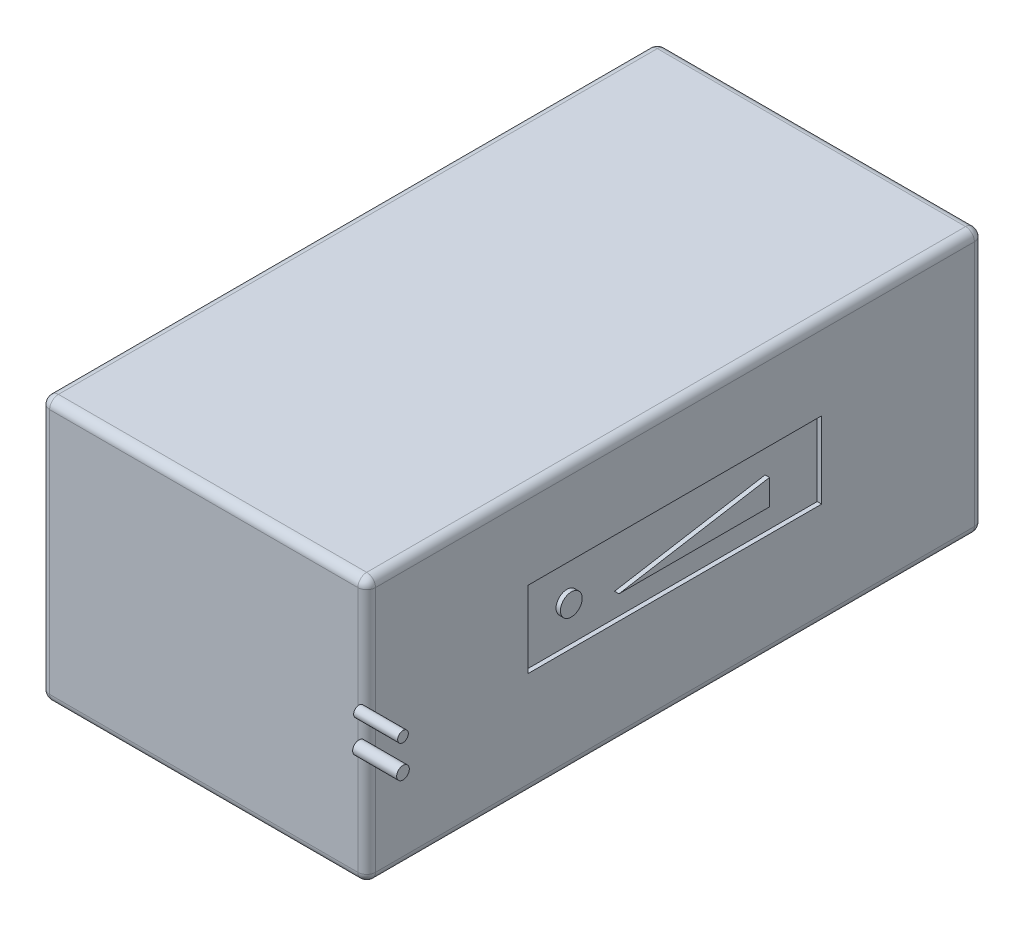
ISO-10303-21;
HEADER;
FILE_DESCRIPTION(('STEP AP214'),'2;1');
FILE_NAME('part.step','',(''),(''),'','','');
FILE_SCHEMA(('AUTOMOTIVE_DESIGN { 1 0 10303 214 1 1 1 1 }'));
ENDSEC;
DATA;
#1=APPLICATION_CONTEXT('core data for automotive mechanical design processes');
#2=APPLICATION_PROTOCOL_DEFINITION('international standard','automotive_design',2000,#1);
#3=PRODUCT_CONTEXT('',#1,'mechanical');
#4=PRODUCT('Part','Part','',(#3));
#5=PRODUCT_RELATED_PRODUCT_CATEGORY('part','',(#4));
#6=PRODUCT_DEFINITION_FORMATION('','',#4);
#7=PRODUCT_DEFINITION_CONTEXT('part definition',#1,'design');
#8=PRODUCT_DEFINITION('design','',#6,#7);
#9=PRODUCT_DEFINITION_SHAPE('','',#8);
#10=(LENGTH_UNIT() NAMED_UNIT(*) SI_UNIT(.MILLI.,.METRE.));
#11=(NAMED_UNIT(*) PLANE_ANGLE_UNIT() SI_UNIT($,.RADIAN.));
#12=(NAMED_UNIT(*) SI_UNIT($,.STERADIAN.) SOLID_ANGLE_UNIT());
#13=UNCERTAINTY_MEASURE_WITH_UNIT(LENGTH_MEASURE(1.E-05),#10,'distance_accuracy_value','');
#14=(GEOMETRIC_REPRESENTATION_CONTEXT(3) GLOBAL_UNCERTAINTY_ASSIGNED_CONTEXT((#13)) GLOBAL_UNIT_ASSIGNED_CONTEXT((#10,
#11,#12)) REPRESENTATION_CONTEXT('',''));
#15=CARTESIAN_POINT('',(0.,0.,0.));
#16=DIRECTION('',(0.,0.,1.));
#17=DIRECTION('',(1.,0.,0.));
#18=AXIS2_PLACEMENT_3D('',#15,#16,#17);
#19=CARTESIAN_POINT('',(47.,28.4814592205187,71.7556522816807));
#20=DIRECTION('',(-1.,0.,0.));
#21=DIRECTION('',(0.,0.,1.));
#22=AXIS2_PLACEMENT_3D('',#19,#20,#21);
#23=CYLINDRICAL_SURFACE('',#22,1.43573257220024);
#24=CARTESIAN_POINT('',(47.,28.4814592205187,71.7556522816807));
#25=DIRECTION('',(1.,0.,0.));
#26=DIRECTION('',(0.,0.,-1.));
#27=AXIS2_PLACEMENT_3D('',#24,#25,#26);
#28=CIRCLE('',#27,1.43573257220024);
#29=CARTESIAN_POINT('',(47.,28.4814592205187,70.3199197094804));
#30=VERTEX_POINT('',#29);
#31=EDGE_CURVE('E11',#30,#30,#28,.T.);
#32=ORIENTED_EDGE('',*,*,#31,.F.);
#33=EDGE_LOOP('',(#32));
#34=FACE_BOUND('',#33,.T.);
#35=CARTESIAN_POINT('',(37.,28.4814592205187,71.7556522816807));
#36=DIRECTION('',(1.,0.,0.));
#37=DIRECTION('',(0.,0.,-1.));
#38=AXIS2_PLACEMENT_3D('',#35,#36,#37);
#39=CIRCLE('',#38,1.43573257220024);
#40=CARTESIAN_POINT('',(37.,28.4814592205187,70.3199197094804));
#41=VERTEX_POINT('',#40);
#42=EDGE_CURVE('E47',#41,#41,#39,.T.);
#43=ORIENTED_EDGE('',*,*,#42,.T.);
#44=EDGE_LOOP('',(#43));
#45=FACE_BOUND('',#44,.T.);
#46=ADVANCED_FACE('F44',(#34,#45),#23,.T.);
#47=CARTESIAN_POINT('',(47.,28.4814592205187,71.7556522816807));
#48=DIRECTION('',(1.,0.,0.));
#49=DIRECTION('',(0.,0.,-1.));
#50=AXIS2_PLACEMENT_3D('',#47,#48,#49);
#51=PLANE('',#50);
#52=ORIENTED_EDGE('',*,*,#31,.T.);
#53=EDGE_LOOP('',(#52));
#54=FACE_BOUND('',#53,.T.);
#55=ADVANCED_FACE('F59',(#54),#51,.T.);
#56=CARTESIAN_POINT('',(37.,28.4814592205187,71.7556522816807));
#57=DIRECTION('',(1.,0.,0.));
#58=DIRECTION('',(0.,0.,-1.));
#59=AXIS2_PLACEMENT_3D('',#56,#57,#58);
#60=PLANE('',#59);
#61=ORIENTED_EDGE('',*,*,#42,.F.);
#62=EDGE_LOOP('',(#61));
#63=FACE_BOUND('',#62,.T.);
#64=ADVANCED_FACE('F57',(#63),#60,.F.);
#65=CLOSED_SHELL('',(#46,#55,#64));
#66=MANIFOLD_SOLID_BREP('B2',#65);
#67=CARTESIAN_POINT('',(47.,35.5772247891686,71.7556522816807));
#68=DIRECTION('',(-1.,0.,0.));
#69=DIRECTION('',(0.,0.,1.));
#70=AXIS2_PLACEMENT_3D('',#67,#68,#69);
#71=CYLINDRICAL_SURFACE('',#70,1.20642120756633);
#72=CARTESIAN_POINT('',(47.,35.5772247891686,71.7556522816807));
#73=DIRECTION('',(1.,0.,0.));
#74=DIRECTION('',(0.,0.,-1.));
#75=AXIS2_PLACEMENT_3D('',#72,#73,#74);
#76=CIRCLE('',#75,1.20642120756633);
#77=CARTESIAN_POINT('',(47.,35.5772247891686,70.5492310741143));
#78=VERTEX_POINT('',#77);
#79=EDGE_CURVE('E43',#78,#78,#76,.T.);
#80=ORIENTED_EDGE('',*,*,#79,.F.);
#81=EDGE_LOOP('',(#80));
#82=FACE_BOUND('',#81,.T.);
#83=CARTESIAN_POINT('',(37.,35.5772247891686,71.7556522816807));
#84=DIRECTION('',(1.,0.,0.));
#85=DIRECTION('',(0.,0.,-1.));
#86=AXIS2_PLACEMENT_3D('',#83,#84,#85);
#87=CIRCLE('',#86,1.20642120756633);
#88=CARTESIAN_POINT('',(37.,35.5772247891686,70.5492310741143));
#89=VERTEX_POINT('',#88);
#90=EDGE_CURVE('E97',#89,#89,#87,.T.);
#91=ORIENTED_EDGE('',*,*,#90,.T.);
#92=EDGE_LOOP('',(#91));
#93=FACE_BOUND('',#92,.T.);
#94=ADVANCED_FACE('F94',(#82,#93),#71,.T.);
#95=CARTESIAN_POINT('',(47.,35.5772247891686,71.7556522816807));
#96=DIRECTION('',(1.,0.,0.));
#97=DIRECTION('',(0.,0.,-1.));
#98=AXIS2_PLACEMENT_3D('',#95,#96,#97);
#99=PLANE('',#98);
#100=ORIENTED_EDGE('',*,*,#79,.T.);
#101=EDGE_LOOP('',(#100));
#102=FACE_BOUND('',#101,.T.);
#103=ADVANCED_FACE('F109',(#102),#99,.T.);
#104=CARTESIAN_POINT('',(37.,35.5772247891686,71.7556522816807));
#105=DIRECTION('',(1.,0.,0.));
#106=DIRECTION('',(0.,0.,-1.));
#107=AXIS2_PLACEMENT_3D('',#104,#105,#106);
#108=PLANE('',#107);
#109=ORIENTED_EDGE('',*,*,#90,.F.);
#110=EDGE_LOOP('',(#109));
#111=FACE_BOUND('',#110,.T.);
#112=ADVANCED_FACE('F107',(#111),#108,.F.);
#113=CLOSED_SHELL('',(#94,#103,#112));
#114=MANIFOLD_SOLID_BREP('B6',#113);
#115=CARTESIAN_POINT('',(37.,60.,-70.));
#116=DIRECTION('',(-1.,0.,0.));
#117=DIRECTION('',(0.,0.,1.));
#118=AXIS2_PLACEMENT_3D('',#115,#116,#117);
#119=PLANE('',#118);
#120=DIRECTION('',(0.,0.,1.));
#121=VECTOR('',#120,1.);
#122=CARTESIAN_POINT('',(37.,41.1324505010592,33.318397953524));
#123=LINE('',#122,#121);
#124=CARTESIAN_POINT('',(37.,41.1324505010592,-33.318397953524));
#125=VERTEX_POINT('',#124);
#126=CARTESIAN_POINT('',(37.,41.1324505010592,33.318397953524));
#127=VERTEX_POINT('',#126);
#128=EDGE_CURVE('E321',#125,#127,#123,.T.);
#129=ORIENTED_EDGE('',*,*,#128,.F.);
#130=DIRECTION('',(0.,1.,0.));
#131=VECTOR('',#130,1.);
#132=CARTESIAN_POINT('',(37.,41.1324505010592,-33.318397953524));
#133=LINE('',#132,#131);
#134=CARTESIAN_POINT('',(37.,23.7626695774212,-33.318397953524));
#135=VERTEX_POINT('',#134);
#136=EDGE_CURVE('E152',#135,#125,#133,.T.);
#137=ORIENTED_EDGE('',*,*,#136,.F.);
#138=DIRECTION('',(0.,0.,-1.));
#139=VECTOR('',#138,1.);
#140=CARTESIAN_POINT('',(37.,23.7626695774211,33.318397953524));
#141=LINE('',#140,#139);
#142=CARTESIAN_POINT('',(37.,23.7626695774211,33.318397953524));
#143=VERTEX_POINT('',#142);
#144=EDGE_CURVE('E310',#143,#135,#141,.T.);
#145=ORIENTED_EDGE('',*,*,#144,.F.);
#146=DIRECTION('',(0.,-1.,0.));
#147=VECTOR('',#146,1.);
#148=CARTESIAN_POINT('',(37.,41.1324505010592,33.318397953524));
#149=LINE('',#148,#147);
#150=EDGE_CURVE('E324',#127,#143,#149,.T.);
#151=ORIENTED_EDGE('',*,*,#150,.F.);
#152=EDGE_LOOP('',(#129,#137,#145,#151));
#153=FACE_BOUND('',#152,.T.);
#154=DIRECTION('',(0.,0.,-1.));
#155=VECTOR('',#154,1.);
#156=CARTESIAN_POINT('',(37.,2.,-70.));
#157=LINE('',#156,#155);
#158=CARTESIAN_POINT('',(37.,2.,68.));
#159=VERTEX_POINT('',#158);
#160=CARTESIAN_POINT('',(37.,2.,-68.));
#161=VERTEX_POINT('',#160);
#162=EDGE_CURVE('E368',#159,#161,#157,.T.);
#163=ORIENTED_EDGE('',*,*,#162,.T.);
#164=DIRECTION('',(0.,-1.,0.));
#165=VECTOR('',#164,1.);
#166=CARTESIAN_POINT('',(37.,60.,-68.));
#167=LINE('',#166,#165);
#168=CARTESIAN_POINT('',(37.,58.,-68.));
#169=VERTEX_POINT('',#168);
#170=EDGE_CURVE('E370',#161,#169,#167,.F.);
#171=ORIENTED_EDGE('',*,*,#170,.T.);
#172=DIRECTION('',(0.,0.,-1.));
#173=VECTOR('',#172,1.);
#174=CARTESIAN_POINT('',(37.,58.,70.));
#175=LINE('',#174,#173);
#176=CARTESIAN_POINT('',(37.,58.,68.));
#177=VERTEX_POINT('',#176);
#178=EDGE_CURVE('E364',#169,#177,#175,.F.);
#179=ORIENTED_EDGE('',*,*,#178,.T.);
#180=DIRECTION('',(0.,-1.,0.));
#181=VECTOR('',#180,1.);
#182=CARTESIAN_POINT('',(37.,60.,68.));
#183=LINE('',#182,#181);
#184=EDGE_CURVE('E366',#177,#159,#183,.T.);
#185=ORIENTED_EDGE('',*,*,#184,.T.);
#186=EDGE_LOOP('',(#163,#171,#179,#185));
#187=FACE_BOUND('',#186,.T.);
#188=ADVANCED_FACE('F135',(#153,#187),#119,.F.);
#189=CARTESIAN_POINT('',(-37.,60.,-70.));
#190=DIRECTION('',(0.,0.,1.));
#191=DIRECTION('',(1.,0.,0.));
#192=AXIS2_PLACEMENT_3D('',#189,#190,#191);
#193=PLANE('',#192);
#194=DIRECTION('',(-1.,0.,0.));
#195=VECTOR('',#194,1.);
#196=CARTESIAN_POINT('',(-37.,2.,-70.));
#197=LINE('',#196,#195);
#198=CARTESIAN_POINT('',(35.,2.,-70.));
#199=VERTEX_POINT('',#198);
#200=CARTESIAN_POINT('',(-35.,2.,-70.));
#201=VERTEX_POINT('',#200);
#202=EDGE_CURVE('E359',#199,#201,#197,.T.);
#203=ORIENTED_EDGE('',*,*,#202,.T.);
#204=DIRECTION('',(0.,-1.,0.));
#205=VECTOR('',#204,1.);
#206=CARTESIAN_POINT('',(-35.,60.,-70.));
#207=LINE('',#206,#205);
#208=CARTESIAN_POINT('',(-35.,58.,-70.));
#209=VERTEX_POINT('',#208);
#210=EDGE_CURVE('E361',#201,#209,#207,.F.);
#211=ORIENTED_EDGE('',*,*,#210,.T.);
#212=DIRECTION('',(-1.,0.,0.));
#213=VECTOR('',#212,1.);
#214=CARTESIAN_POINT('',(37.,58.,-70.));
#215=LINE('',#214,#213);
#216=CARTESIAN_POINT('',(35.,58.,-70.));
#217=VERTEX_POINT('',#216);
#218=EDGE_CURVE('E355',#209,#217,#215,.F.);
#219=ORIENTED_EDGE('',*,*,#218,.T.);
#220=DIRECTION('',(0.,-1.,0.));
#221=VECTOR('',#220,1.);
#222=CARTESIAN_POINT('',(35.,60.,-70.));
#223=LINE('',#222,#221);
#224=EDGE_CURVE('E357',#217,#199,#223,.T.);
#225=ORIENTED_EDGE('',*,*,#224,.T.);
#226=EDGE_LOOP('',(#203,#211,#219,#225));
#227=FACE_BOUND('',#226,.T.);
#228=ADVANCED_FACE('F484',(#227),#193,.F.);
#229=CARTESIAN_POINT('',(-37.,60.,-70.));
#230=DIRECTION('',(1.,0.,0.));
#231=DIRECTION('',(0.,0.,-1.));
#232=AXIS2_PLACEMENT_3D('',#229,#230,#231);
#233=PLANE('',#232);
#234=DIRECTION('',(0.,-1.,0.));
#235=VECTOR('',#234,1.);
#236=CARTESIAN_POINT('',(-37.,60.,-68.));
#237=LINE('',#236,#235);
#238=CARTESIAN_POINT('',(-37.,58.,-68.));
#239=VERTEX_POINT('',#238);
#240=CARTESIAN_POINT('',(-37.,2.,-68.));
#241=VERTEX_POINT('',#240);
#242=EDGE_CURVE('E341',#239,#241,#237,.T.);
#243=ORIENTED_EDGE('',*,*,#242,.T.);
#244=DIRECTION('',(0.,0.,1.));
#245=VECTOR('',#244,1.);
#246=CARTESIAN_POINT('',(-37.,2.,-70.));
#247=LINE('',#246,#245);
#248=CARTESIAN_POINT('',(-37.,2.,68.));
#249=VERTEX_POINT('',#248);
#250=EDGE_CURVE('E343',#241,#249,#247,.T.);
#251=ORIENTED_EDGE('',*,*,#250,.T.);
#252=DIRECTION('',(0.,-1.,0.));
#253=VECTOR('',#252,1.);
#254=CARTESIAN_POINT('',(-37.,60.,68.));
#255=LINE('',#254,#253);
#256=CARTESIAN_POINT('',(-37.,58.,68.));
#257=VERTEX_POINT('',#256);
#258=EDGE_CURVE('E339',#249,#257,#255,.F.);
#259=ORIENTED_EDGE('',*,*,#258,.T.);
#260=DIRECTION('',(0.,0.,1.));
#261=VECTOR('',#260,1.);
#262=CARTESIAN_POINT('',(-37.,58.,-70.));
#263=LINE('',#262,#261);
#264=EDGE_CURVE('E337',#257,#239,#263,.F.);
#265=ORIENTED_EDGE('',*,*,#264,.T.);
#266=EDGE_LOOP('',(#243,#251,#259,#265));
#267=FACE_BOUND('',#266,.T.);
#268=ADVANCED_FACE('F541',(#267),#233,.F.);
#269=CARTESIAN_POINT('',(-37.,60.,70.));
#270=DIRECTION('',(0.,0.,-1.));
#271=DIRECTION('',(-1.,0.,0.));
#272=AXIS2_PLACEMENT_3D('',#269,#270,#271);
#273=PLANE('',#272);
#274=DIRECTION('',(0.,-1.,0.));
#275=VECTOR('',#274,1.);
#276=CARTESIAN_POINT('',(-35.,60.,70.));
#277=LINE('',#276,#275);
#278=CARTESIAN_POINT('',(-35.,58.,70.));
#279=VERTEX_POINT('',#278);
#280=CARTESIAN_POINT('',(-35.,2.,70.));
#281=VERTEX_POINT('',#280);
#282=EDGE_CURVE('E377',#279,#281,#277,.T.);
#283=ORIENTED_EDGE('',*,*,#282,.T.);
#284=DIRECTION('',(1.,0.,0.));
#285=VECTOR('',#284,1.);
#286=CARTESIAN_POINT('',(-37.,2.,70.));
#287=LINE('',#286,#285);
#288=CARTESIAN_POINT('',(35.,2.,70.));
#289=VERTEX_POINT('',#288);
#290=EDGE_CURVE('E380',#281,#289,#287,.T.);
#291=ORIENTED_EDGE('',*,*,#290,.T.);
#292=DIRECTION('',(0.,-1.,0.));
#293=VECTOR('',#292,1.);
#294=CARTESIAN_POINT('',(35.,60.,70.));
#295=LINE('',#294,#293);
#296=CARTESIAN_POINT('',(35.,58.,70.));
#297=VERTEX_POINT('',#296);
#298=EDGE_CURVE('E375',#289,#297,#295,.F.);
#299=ORIENTED_EDGE('',*,*,#298,.T.);
#300=DIRECTION('',(1.,0.,0.));
#301=VECTOR('',#300,1.);
#302=CARTESIAN_POINT('',(-37.,58.,70.));
#303=LINE('',#302,#301);
#304=EDGE_CURVE('E373',#297,#279,#303,.F.);
#305=ORIENTED_EDGE('',*,*,#304,.T.);
#306=EDGE_LOOP('',(#283,#291,#299,#305));
#307=FACE_BOUND('',#306,.T.);
#308=ADVANCED_FACE('F543',(#307),#273,.F.);
#309=CARTESIAN_POINT('',(0.,60.,0.));
#310=DIRECTION('',(0.,1.,0.));
#311=DIRECTION('',(0.,0.,1.));
#312=AXIS2_PLACEMENT_3D('',#309,#310,#311);
#313=PLANE('',#312);
#314=DIRECTION('',(0.,0.,1.));
#315=VECTOR('',#314,1.);
#316=CARTESIAN_POINT('',(-35.,60.,70.));
#317=LINE('',#316,#315);
#318=CARTESIAN_POINT('',(-35.,60.,-68.));
#319=VERTEX_POINT('',#318);
#320=CARTESIAN_POINT('',(-35.,60.,68.));
#321=VERTEX_POINT('',#320);
#322=EDGE_CURVE('E144',#319,#321,#317,.T.);
#323=ORIENTED_EDGE('',*,*,#322,.T.);
#324=DIRECTION('',(1.,0.,0.));
#325=VECTOR('',#324,1.);
#326=CARTESIAN_POINT('',(37.,60.,68.));
#327=LINE('',#326,#325);
#328=CARTESIAN_POINT('',(35.,60.,68.));
#329=VERTEX_POINT('',#328);
#330=EDGE_CURVE('E92',#321,#329,#327,.T.);
#331=ORIENTED_EDGE('',*,*,#330,.T.);
#332=DIRECTION('',(0.,0.,-1.));
#333=VECTOR('',#332,1.);
#334=CARTESIAN_POINT('',(35.,60.,-70.));
#335=LINE('',#334,#333);
#336=CARTESIAN_POINT('',(35.,60.,-68.));
#337=VERTEX_POINT('',#336);
#338=EDGE_CURVE('E382',#329,#337,#335,.T.);
#339=ORIENTED_EDGE('',*,*,#338,.T.);
#340=DIRECTION('',(-1.,0.,0.));
#341=VECTOR('',#340,1.);
#342=CARTESIAN_POINT('',(-37.,60.,-68.));
#343=LINE('',#342,#341);
#344=EDGE_CURVE('E384',#337,#319,#343,.T.);
#345=ORIENTED_EDGE('',*,*,#344,.T.);
#346=EDGE_LOOP('',(#323,#331,#339,#345));
#347=FACE_BOUND('',#346,.T.);
#348=ADVANCED_FACE('F500',(#347),#313,.T.);
#349=CARTESIAN_POINT('',(0.,0.,0.));
#350=DIRECTION('',(0.,1.,0.));
#351=DIRECTION('',(0.,0.,1.));
#352=AXIS2_PLACEMENT_3D('',#349,#350,#351);
#353=PLANE('',#352);
#354=DIRECTION('',(1.,0.,0.));
#355=VECTOR('',#354,1.);
#356=CARTESIAN_POINT('',(0.,0.,68.));
#357=LINE('',#356,#355);
#358=CARTESIAN_POINT('',(35.,0.,68.));
#359=VERTEX_POINT('',#358);
#360=CARTESIAN_POINT('',(-35.,0.,68.));
#361=VERTEX_POINT('',#360);
#362=EDGE_CURVE('E346',#359,#361,#357,.F.);
#363=ORIENTED_EDGE('',*,*,#362,.T.);
#364=DIRECTION('',(0.,0.,1.));
#365=VECTOR('',#364,1.);
#366=CARTESIAN_POINT('',(-35.,0.,0.));
#367=LINE('',#366,#365);
#368=CARTESIAN_POINT('',(-35.,0.,-68.));
#369=VERTEX_POINT('',#368);
#370=EDGE_CURVE('E352',#361,#369,#367,.F.);
#371=ORIENTED_EDGE('',*,*,#370,.T.);
#372=DIRECTION('',(-1.,0.,0.));
#373=VECTOR('',#372,1.);
#374=CARTESIAN_POINT('',(0.,0.,-68.));
#375=LINE('',#374,#373);
#376=CARTESIAN_POINT('',(35.,0.,-68.));
#377=VERTEX_POINT('',#376);
#378=EDGE_CURVE('E350',#369,#377,#375,.F.);
#379=ORIENTED_EDGE('',*,*,#378,.T.);
#380=DIRECTION('',(0.,0.,-1.));
#381=VECTOR('',#380,1.);
#382=CARTESIAN_POINT('',(35.,0.,0.));
#383=LINE('',#382,#381);
#384=EDGE_CURVE('E348',#377,#359,#383,.F.);
#385=ORIENTED_EDGE('',*,*,#384,.T.);
#386=EDGE_LOOP('',(#363,#371,#379,#385));
#387=FACE_BOUND('',#386,.T.);
#388=ADVANCED_FACE('F529',(#387),#353,.F.);
#389=CARTESIAN_POINT('',(35.,58.,0.));
#390=DIRECTION('',(0.,0.,1.));
#391=DIRECTION('',(1.,0.,0.));
#392=AXIS2_PLACEMENT_3D('',#389,#390,#391);
#393=CYLINDRICAL_SURFACE('',#392,2.);
#394=CARTESIAN_POINT('',(35.,58.,-68.));
#395=DIRECTION('',(0.,0.,-1.));
#396=DIRECTION('',(-1.,0.,0.));
#397=AXIS2_PLACEMENT_3D('',#394,#395,#396);
#398=CIRCLE('',#397,2.);
#399=EDGE_CURVE('E139',#337,#169,#398,.T.);
#400=ORIENTED_EDGE('',*,*,#399,.F.);
#401=ORIENTED_EDGE('',*,*,#338,.F.);
#402=CARTESIAN_POINT('',(35.,58.,68.));
#403=DIRECTION('',(0.,0.,1.));
#404=DIRECTION('',(1.,0.,0.));
#405=AXIS2_PLACEMENT_3D('',#402,#403,#404);
#406=CIRCLE('',#405,2.);
#407=EDGE_CURVE('E445',#177,#329,#406,.T.);
#408=ORIENTED_EDGE('',*,*,#407,.F.);
#409=ORIENTED_EDGE('',*,*,#178,.F.);
#410=EDGE_LOOP('',(#400,#401,#408,#409));
#411=FACE_BOUND('',#410,.T.);
#412=ADVANCED_FACE('F137',(#411),#393,.T.);
#413=CARTESIAN_POINT('',(35.,58.,-68.));
#414=DIRECTION('',(0.,0.,1.));
#415=DIRECTION('',(1.,0.,0.));
#416=AXIS2_PLACEMENT_3D('',#413,#414,#415);
#417=SPHERICAL_SURFACE('',#416,2.);
#418=CARTESIAN_POINT('',(35.,58.,-68.));
#419=DIRECTION('',(1.,0.,0.));
#420=DIRECTION('',(0.,0.,-1.));
#421=AXIS2_PLACEMENT_3D('',#418,#419,#420);
#422=CIRCLE('',#421,2.);
#423=EDGE_CURVE('E441',#337,#217,#422,.F.);
#424=ORIENTED_EDGE('',*,*,#423,.F.);
#425=ORIENTED_EDGE('',*,*,#399,.T.);
#426=CARTESIAN_POINT('',(35.,58.,-68.));
#427=DIRECTION('',(0.,1.,0.));
#428=DIRECTION('',(0.,0.,1.));
#429=AXIS2_PLACEMENT_3D('',#426,#427,#428);
#430=CIRCLE('',#429,2.);
#431=EDGE_CURVE('E444',#217,#169,#430,.F.);
#432=ORIENTED_EDGE('',*,*,#431,.F.);
#433=EDGE_LOOP('',(#424,#425,#432));
#434=FACE_BOUND('',#433,.T.);
#435=ADVANCED_FACE('F458',(#434),#417,.T.);
#436=CARTESIAN_POINT('',(35.,58.,68.));
#437=DIRECTION('',(0.,0.,1.));
#438=DIRECTION('',(1.,0.,0.));
#439=AXIS2_PLACEMENT_3D('',#436,#437,#438);
#440=SPHERICAL_SURFACE('',#439,2.);
#441=CARTESIAN_POINT('',(35.,58.,68.));
#442=DIRECTION('',(0.,1.,0.));
#443=DIRECTION('',(0.,0.,1.));
#444=AXIS2_PLACEMENT_3D('',#441,#442,#443);
#445=CIRCLE('',#444,2.);
#446=EDGE_CURVE('E436',#177,#297,#445,.F.);
#447=ORIENTED_EDGE('',*,*,#446,.F.);
#448=ORIENTED_EDGE('',*,*,#407,.T.);
#449=CARTESIAN_POINT('',(35.,58.,68.));
#450=DIRECTION('',(1.,0.,0.));
#451=DIRECTION('',(0.,0.,-1.));
#452=AXIS2_PLACEMENT_3D('',#449,#450,#451);
#453=CIRCLE('',#452,2.);
#454=EDGE_CURVE('E439',#297,#329,#453,.F.);
#455=ORIENTED_EDGE('',*,*,#454,.F.);
#456=EDGE_LOOP('',(#447,#448,#455));
#457=FACE_BOUND('',#456,.T.);
#458=ADVANCED_FACE('F514',(#457),#440,.T.);
#459=CARTESIAN_POINT('',(35.,60.,-68.));
#460=DIRECTION('',(0.,-1.,0.));
#461=DIRECTION('',(0.,0.,-1.));
#462=AXIS2_PLACEMENT_3D('',#459,#460,#461);
#463=CYLINDRICAL_SURFACE('',#462,2.);
#464=ORIENTED_EDGE('',*,*,#431,.T.);
#465=ORIENTED_EDGE('',*,*,#170,.F.);
#466=CARTESIAN_POINT('',(35.,2.,-68.));
#467=DIRECTION('',(0.,-1.,0.));
#468=DIRECTION('',(0.,0.,-1.));
#469=AXIS2_PLACEMENT_3D('',#466,#467,#468);
#470=CIRCLE('',#469,2.);
#471=EDGE_CURVE('E430',#199,#161,#470,.T.);
#472=ORIENTED_EDGE('',*,*,#471,.F.);
#473=ORIENTED_EDGE('',*,*,#224,.F.);
#474=EDGE_LOOP('',(#464,#465,#472,#473));
#475=FACE_BOUND('',#474,.T.);
#476=ADVANCED_FACE('F468',(#475),#463,.T.);
#477=CARTESIAN_POINT('',(0.,58.,-68.));
#478=DIRECTION('',(1.,0.,0.));
#479=DIRECTION('',(0.,0.,-1.));
#480=AXIS2_PLACEMENT_3D('',#477,#478,#479);
#481=CYLINDRICAL_SURFACE('',#480,2.);
#482=ORIENTED_EDGE('',*,*,#423,.T.);
#483=ORIENTED_EDGE('',*,*,#218,.F.);
#484=CARTESIAN_POINT('',(-35.,58.,-68.));
#485=DIRECTION('',(-1.,0.,0.));
#486=DIRECTION('',(0.,0.,1.));
#487=AXIS2_PLACEMENT_3D('',#484,#485,#486);
#488=CIRCLE('',#487,2.);
#489=EDGE_CURVE('E427',#319,#209,#488,.T.);
#490=ORIENTED_EDGE('',*,*,#489,.F.);
#491=ORIENTED_EDGE('',*,*,#344,.F.);
#492=EDGE_LOOP('',(#482,#483,#490,#491));
#493=FACE_BOUND('',#492,.T.);
#494=ADVANCED_FACE('F497',(#493),#481,.T.);
#495=CARTESIAN_POINT('',(-35.,58.,0.));
#496=DIRECTION('',(0.,0.,-1.));
#497=DIRECTION('',(-1.,0.,0.));
#498=AXIS2_PLACEMENT_3D('',#495,#496,#497);
#499=CYLINDRICAL_SURFACE('',#498,2.);
#500=CARTESIAN_POINT('',(-35.,58.,68.));
#501=DIRECTION('',(0.,0.,1.));
#502=DIRECTION('',(1.,0.,0.));
#503=AXIS2_PLACEMENT_3D('',#500,#501,#502);
#504=CIRCLE('',#503,2.);
#505=EDGE_CURVE('E421',#321,#257,#504,.T.);
#506=ORIENTED_EDGE('',*,*,#505,.F.);
#507=ORIENTED_EDGE('',*,*,#322,.F.);
#508=CARTESIAN_POINT('',(-35.,58.,-68.));
#509=DIRECTION('',(0.,0.,-1.));
#510=DIRECTION('',(-1.,0.,0.));
#511=AXIS2_PLACEMENT_3D('',#508,#509,#510);
#512=CIRCLE('',#511,2.);
#513=EDGE_CURVE('E424',#239,#319,#512,.T.);
#514=ORIENTED_EDGE('',*,*,#513,.F.);
#515=ORIENTED_EDGE('',*,*,#264,.F.);
#516=EDGE_LOOP('',(#506,#507,#514,#515));
#517=FACE_BOUND('',#516,.T.);
#518=ADVANCED_FACE('F504',(#517),#499,.T.);
#519=CARTESIAN_POINT('',(0.,58.,68.));
#520=DIRECTION('',(-1.,0.,0.));
#521=DIRECTION('',(0.,0.,1.));
#522=AXIS2_PLACEMENT_3D('',#519,#520,#521);
#523=CYLINDRICAL_SURFACE('',#522,2.);
#524=ORIENTED_EDGE('',*,*,#454,.T.);
#525=ORIENTED_EDGE('',*,*,#330,.F.);
#526=CARTESIAN_POINT('',(-35.,58.,68.));
#527=DIRECTION('',(-1.,0.,0.));
#528=DIRECTION('',(0.,0.,1.));
#529=AXIS2_PLACEMENT_3D('',#526,#527,#528);
#530=CIRCLE('',#529,2.);
#531=EDGE_CURVE('E418',#279,#321,#530,.T.);
#532=ORIENTED_EDGE('',*,*,#531,.F.);
#533=ORIENTED_EDGE('',*,*,#304,.F.);
#534=EDGE_LOOP('',(#524,#525,#532,#533));
#535=FACE_BOUND('',#534,.T.);
#536=ADVANCED_FACE('F513',(#535),#523,.T.);
#537=CARTESIAN_POINT('',(35.,60.,68.));
#538=DIRECTION('',(0.,-1.,0.));
#539=DIRECTION('',(0.,0.,-1.));
#540=AXIS2_PLACEMENT_3D('',#537,#538,#539);
#541=CYLINDRICAL_SURFACE('',#540,2.);
#542=ORIENTED_EDGE('',*,*,#446,.T.);
#543=ORIENTED_EDGE('',*,*,#298,.F.);
#544=CARTESIAN_POINT('',(35.,2.,68.));
#545=DIRECTION('',(0.,-1.,0.));
#546=DIRECTION('',(0.,0.,-1.));
#547=AXIS2_PLACEMENT_3D('',#544,#545,#546);
#548=CIRCLE('',#547,2.);
#549=EDGE_CURVE('E415',#159,#289,#548,.T.);
#550=ORIENTED_EDGE('',*,*,#549,.F.);
#551=ORIENTED_EDGE('',*,*,#184,.F.);
#552=EDGE_LOOP('',(#542,#543,#550,#551));
#553=FACE_BOUND('',#552,.T.);
#554=ADVANCED_FACE('F518',(#553),#541,.T.);
#555=CARTESIAN_POINT('',(35.,2.,-70.));
#556=DIRECTION('',(0.,0.,-1.));
#557=DIRECTION('',(-1.,0.,0.));
#558=AXIS2_PLACEMENT_3D('',#555,#556,#557);
#559=CYLINDRICAL_SURFACE('',#558,2.);
#560=CARTESIAN_POINT('',(35.,2.,-68.));
#561=DIRECTION('',(0.,0.,-1.));
#562=DIRECTION('',(-1.,0.,0.));
#563=AXIS2_PLACEMENT_3D('',#560,#561,#562);
#564=CIRCLE('',#563,2.);
#565=EDGE_CURVE('E433',#161,#377,#564,.T.);
#566=ORIENTED_EDGE('',*,*,#565,.F.);
#567=ORIENTED_EDGE('',*,*,#162,.F.);
#568=CARTESIAN_POINT('',(35.,2.,68.));
#569=DIRECTION('',(0.,0.,1.));
#570=DIRECTION('',(1.,0.,0.));
#571=AXIS2_PLACEMENT_3D('',#568,#569,#570);
#572=CIRCLE('',#571,2.);
#573=EDGE_CURVE('E412',#359,#159,#572,.T.);
#574=ORIENTED_EDGE('',*,*,#573,.F.);
#575=ORIENTED_EDGE('',*,*,#384,.F.);
#576=EDGE_LOOP('',(#566,#567,#574,#575));
#577=FACE_BOUND('',#576,.T.);
#578=ADVANCED_FACE('F472',(#577),#559,.T.);
#579=CARTESIAN_POINT('',(35.,2.,-68.));
#580=DIRECTION('',(0.,0.,1.));
#581=DIRECTION('',(1.,0.,0.));
#582=AXIS2_PLACEMENT_3D('',#579,#580,#581);
#583=SPHERICAL_SURFACE('',#582,2.);
#584=ORIENTED_EDGE('',*,*,#471,.T.);
#585=ORIENTED_EDGE('',*,*,#565,.T.);
#586=CARTESIAN_POINT('',(35.,2.,-68.));
#587=DIRECTION('',(1.,0.,0.));
#588=DIRECTION('',(0.,0.,-1.));
#589=AXIS2_PLACEMENT_3D('',#586,#587,#588);
#590=CIRCLE('',#589,2.);
#591=EDGE_CURVE('E409',#199,#377,#590,.F.);
#592=ORIENTED_EDGE('',*,*,#591,.F.);
#593=EDGE_LOOP('',(#584,#585,#592));
#594=FACE_BOUND('',#593,.T.);
#595=ADVANCED_FACE('F476',(#594),#583,.T.);
#596=CARTESIAN_POINT('',(-35.,58.,-68.));
#597=DIRECTION('',(0.,0.,1.));
#598=DIRECTION('',(1.,0.,0.));
#599=AXIS2_PLACEMENT_3D('',#596,#597,#598);
#600=SPHERICAL_SURFACE('',#599,2.);
#601=ORIENTED_EDGE('',*,*,#513,.T.);
#602=ORIENTED_EDGE('',*,*,#489,.T.);
#603=CARTESIAN_POINT('',(-35.,58.,-68.));
#604=DIRECTION('',(0.,1.,0.));
#605=DIRECTION('',(0.,0.,1.));
#606=AXIS2_PLACEMENT_3D('',#603,#604,#605);
#607=CIRCLE('',#606,2.);
#608=EDGE_CURVE('E407',#239,#209,#607,.F.);
#609=ORIENTED_EDGE('',*,*,#608,.F.);
#610=EDGE_LOOP('',(#601,#602,#609));
#611=FACE_BOUND('',#610,.T.);
#612=ADVANCED_FACE('F494',(#611),#600,.T.);
#613=CARTESIAN_POINT('',(-35.,58.,68.));
#614=DIRECTION('',(0.,0.,1.));
#615=DIRECTION('',(1.,0.,0.));
#616=AXIS2_PLACEMENT_3D('',#613,#614,#615);
#617=SPHERICAL_SURFACE('',#616,2.);
#618=ORIENTED_EDGE('',*,*,#531,.T.);
#619=ORIENTED_EDGE('',*,*,#505,.T.);
#620=CARTESIAN_POINT('',(-35.,58.,68.));
#621=DIRECTION('',(0.,1.,0.));
#622=DIRECTION('',(0.,0.,1.));
#623=AXIS2_PLACEMENT_3D('',#620,#621,#622);
#624=CIRCLE('',#623,2.);
#625=EDGE_CURVE('E404',#279,#257,#624,.F.);
#626=ORIENTED_EDGE('',*,*,#625,.F.);
#627=EDGE_LOOP('',(#618,#619,#626));
#628=FACE_BOUND('',#627,.T.);
#629=ADVANCED_FACE('F509',(#628),#617,.T.);
#630=CARTESIAN_POINT('',(35.,2.,68.));
#631=DIRECTION('',(0.,0.,1.));
#632=DIRECTION('',(1.,0.,0.));
#633=AXIS2_PLACEMENT_3D('',#630,#631,#632);
#634=SPHERICAL_SURFACE('',#633,2.);
#635=ORIENTED_EDGE('',*,*,#573,.T.);
#636=ORIENTED_EDGE('',*,*,#549,.T.);
#637=CARTESIAN_POINT('',(35.,2.,68.));
#638=DIRECTION('',(1.,0.,0.));
#639=DIRECTION('',(0.,0.,-1.));
#640=AXIS2_PLACEMENT_3D('',#637,#638,#639);
#641=CIRCLE('',#640,2.);
#642=EDGE_CURVE('E401',#359,#289,#641,.F.);
#643=ORIENTED_EDGE('',*,*,#642,.F.);
#644=EDGE_LOOP('',(#635,#636,#643));
#645=FACE_BOUND('',#644,.T.);
#646=ADVANCED_FACE('F521',(#645),#634,.T.);
#647=CARTESIAN_POINT('',(-37.,2.,-68.));
#648=DIRECTION('',(-1.,0.,0.));
#649=DIRECTION('',(0.,0.,1.));
#650=AXIS2_PLACEMENT_3D('',#647,#648,#649);
#651=CYLINDRICAL_SURFACE('',#650,2.);
#652=ORIENTED_EDGE('',*,*,#591,.T.);
#653=ORIENTED_EDGE('',*,*,#378,.F.);
#654=CARTESIAN_POINT('',(-35.,2.,-68.));
#655=DIRECTION('',(-1.,0.,0.));
#656=DIRECTION('',(0.,0.,1.));
#657=AXIS2_PLACEMENT_3D('',#654,#655,#656);
#658=CIRCLE('',#657,2.);
#659=EDGE_CURVE('E398',#201,#369,#658,.T.);
#660=ORIENTED_EDGE('',*,*,#659,.F.);
#661=ORIENTED_EDGE('',*,*,#202,.F.);
#662=EDGE_LOOP('',(#652,#653,#660,#661));
#663=FACE_BOUND('',#662,.T.);
#664=ADVANCED_FACE('F481',(#663),#651,.T.);
#665=CARTESIAN_POINT('',(-35.,60.,-68.));
#666=DIRECTION('',(0.,-1.,0.));
#667=DIRECTION('',(0.,0.,-1.));
#668=AXIS2_PLACEMENT_3D('',#665,#666,#667);
#669=CYLINDRICAL_SURFACE('',#668,2.);
#670=ORIENTED_EDGE('',*,*,#608,.T.);
#671=ORIENTED_EDGE('',*,*,#210,.F.);
#672=CARTESIAN_POINT('',(-35.,2.,-68.));
#673=DIRECTION('',(0.,-1.,0.));
#674=DIRECTION('',(0.,0.,-1.));
#675=AXIS2_PLACEMENT_3D('',#672,#673,#674);
#676=CIRCLE('',#675,2.);
#677=EDGE_CURVE('E395',#241,#201,#676,.T.);
#678=ORIENTED_EDGE('',*,*,#677,.F.);
#679=ORIENTED_EDGE('',*,*,#242,.F.);
#680=EDGE_LOOP('',(#670,#671,#678,#679));
#681=FACE_BOUND('',#680,.T.);
#682=ADVANCED_FACE('F487',(#681),#669,.T.);
#683=CARTESIAN_POINT('',(-35.,60.,68.));
#684=DIRECTION('',(0.,-1.,0.));
#685=DIRECTION('',(0.,0.,-1.));
#686=AXIS2_PLACEMENT_3D('',#683,#684,#685);
#687=CYLINDRICAL_SURFACE('',#686,2.);
#688=ORIENTED_EDGE('',*,*,#625,.T.);
#689=ORIENTED_EDGE('',*,*,#258,.F.);
#690=CARTESIAN_POINT('',(-35.,2.,68.));
#691=DIRECTION('',(0.,-1.,0.));
#692=DIRECTION('',(0.,0.,-1.));
#693=AXIS2_PLACEMENT_3D('',#690,#691,#692);
#694=CIRCLE('',#693,2.);
#695=EDGE_CURVE('E392',#281,#249,#694,.T.);
#696=ORIENTED_EDGE('',*,*,#695,.F.);
#697=ORIENTED_EDGE('',*,*,#282,.F.);
#698=EDGE_LOOP('',(#688,#689,#696,#697));
#699=FACE_BOUND('',#698,.T.);
#700=ADVANCED_FACE('F539',(#699),#687,.T.);
#701=CARTESIAN_POINT('',(-37.,2.,68.));
#702=DIRECTION('',(1.,0.,0.));
#703=DIRECTION('',(0.,0.,-1.));
#704=AXIS2_PLACEMENT_3D('',#701,#702,#703);
#705=CYLINDRICAL_SURFACE('',#704,2.);
#706=ORIENTED_EDGE('',*,*,#642,.T.);
#707=ORIENTED_EDGE('',*,*,#290,.F.);
#708=CARTESIAN_POINT('',(-35.,2.,68.));
#709=DIRECTION('',(-1.,0.,0.));
#710=DIRECTION('',(0.,0.,1.));
#711=AXIS2_PLACEMENT_3D('',#708,#709,#710);
#712=CIRCLE('',#711,2.);
#713=EDGE_CURVE('E390',#361,#281,#712,.T.);
#714=ORIENTED_EDGE('',*,*,#713,.F.);
#715=ORIENTED_EDGE('',*,*,#362,.F.);
#716=EDGE_LOOP('',(#706,#707,#714,#715));
#717=FACE_BOUND('',#716,.T.);
#718=ADVANCED_FACE('F526',(#717),#705,.T.);
#719=CARTESIAN_POINT('',(-35.,2.,-68.));
#720=DIRECTION('',(0.,0.,1.));
#721=DIRECTION('',(1.,0.,0.));
#722=AXIS2_PLACEMENT_3D('',#719,#720,#721);
#723=SPHERICAL_SURFACE('',#722,2.);
#724=ORIENTED_EDGE('',*,*,#677,.T.);
#725=ORIENTED_EDGE('',*,*,#659,.T.);
#726=CARTESIAN_POINT('',(-35.,2.,-68.));
#727=DIRECTION('',(0.,0.,-1.));
#728=DIRECTION('',(-1.,0.,0.));
#729=AXIS2_PLACEMENT_3D('',#726,#727,#728);
#730=CIRCLE('',#729,2.);
#731=EDGE_CURVE('E388',#241,#369,#730,.F.);
#732=ORIENTED_EDGE('',*,*,#731,.F.);
#733=EDGE_LOOP('',(#724,#725,#732));
#734=FACE_BOUND('',#733,.T.);
#735=ADVANCED_FACE('F646',(#734),#723,.T.);
#736=CARTESIAN_POINT('',(-35.,2.,68.));
#737=DIRECTION('',(0.,0.,1.));
#738=DIRECTION('',(1.,0.,0.));
#739=AXIS2_PLACEMENT_3D('',#736,#737,#738);
#740=SPHERICAL_SURFACE('',#739,2.);
#741=ORIENTED_EDGE('',*,*,#713,.T.);
#742=ORIENTED_EDGE('',*,*,#695,.T.);
#743=CARTESIAN_POINT('',(-35.,2.,68.));
#744=DIRECTION('',(0.,0.,1.));
#745=DIRECTION('',(1.,0.,0.));
#746=AXIS2_PLACEMENT_3D('',#743,#744,#745);
#747=CIRCLE('',#746,2.);
#748=EDGE_CURVE('E331',#361,#249,#747,.F.);
#749=ORIENTED_EDGE('',*,*,#748,.F.);
#750=EDGE_LOOP('',(#741,#742,#749));
#751=FACE_BOUND('',#750,.T.);
#752=ADVANCED_FACE('F535',(#751),#740,.T.);
#753=CARTESIAN_POINT('',(-35.,2.,-70.));
#754=DIRECTION('',(0.,0.,1.));
#755=DIRECTION('',(1.,0.,0.));
#756=AXIS2_PLACEMENT_3D('',#753,#754,#755);
#757=CYLINDRICAL_SURFACE('',#756,2.);
#758=ORIENTED_EDGE('',*,*,#731,.T.);
#759=ORIENTED_EDGE('',*,*,#370,.F.);
#760=ORIENTED_EDGE('',*,*,#748,.T.);
#761=ORIENTED_EDGE('',*,*,#250,.F.);
#762=EDGE_LOOP('',(#758,#759,#760,#761));
#763=FACE_BOUND('',#762,.T.);
#764=ADVANCED_FACE('F532',(#763),#757,.T.);
#765=CARTESIAN_POINT('',(36.,41.1324505010592,-33.318397953524));
#766=DIRECTION('',(0.,0.,-1.));
#767=DIRECTION('',(0.,1.,0.));
#768=AXIS2_PLACEMENT_3D('',#765,#766,#767);
#769=PLANE('',#768);
#770=ORIENTED_EDGE('',*,*,#136,.T.);
#771=DIRECTION('',(1.,0.,0.));
#772=VECTOR('',#771,1.);
#773=CARTESIAN_POINT('',(36.,41.1324505010592,-33.318397953524));
#774=LINE('',#773,#772);
#775=CARTESIAN_POINT('',(36.,41.1324505010592,-33.318397953524));
#776=VERTEX_POINT('',#775);
#777=EDGE_CURVE('E319',#776,#125,#774,.T.);
#778=ORIENTED_EDGE('',*,*,#777,.F.);
#779=DIRECTION('',(0.,1.,0.));
#780=VECTOR('',#779,1.);
#781=CARTESIAN_POINT('',(36.,41.1324505010592,-33.318397953524));
#782=LINE('',#781,#780);
#783=CARTESIAN_POINT('',(36.,23.7626695774212,-33.318397953524));
#784=VERTEX_POINT('',#783);
#785=EDGE_CURVE('E306',#784,#776,#782,.T.);
#786=ORIENTED_EDGE('',*,*,#785,.F.);
#787=DIRECTION('',(1.,0.,0.));
#788=VECTOR('',#787,1.);
#789=CARTESIAN_POINT('',(36.,23.7626695774212,-33.318397953524));
#790=LINE('',#789,#788);
#791=EDGE_CURVE('E329',#784,#135,#790,.T.);
#792=ORIENTED_EDGE('',*,*,#791,.T.);
#793=EDGE_LOOP('',(#770,#778,#786,#792));
#794=FACE_BOUND('',#793,.T.);
#795=ADVANCED_FACE('F627',(#794),#769,.F.);
#796=CARTESIAN_POINT('',(36.,23.7626695774211,33.318397953524));
#797=DIRECTION('',(0.,-1.,0.));
#798=DIRECTION('',(0.,0.,-1.));
#799=AXIS2_PLACEMENT_3D('',#796,#797,#798);
#800=PLANE('',#799);
#801=ORIENTED_EDGE('',*,*,#144,.T.);
#802=ORIENTED_EDGE('',*,*,#791,.F.);
#803=DIRECTION('',(0.,0.,-1.));
#804=VECTOR('',#803,1.);
#805=CARTESIAN_POINT('',(36.,23.7626695774211,33.318397953524));
#806=LINE('',#805,#804);
#807=CARTESIAN_POINT('',(36.,23.7626695774211,33.318397953524));
#808=VERTEX_POINT('',#807);
#809=EDGE_CURVE('E316',#808,#784,#806,.T.);
#810=ORIENTED_EDGE('',*,*,#809,.F.);
#811=DIRECTION('',(1.,0.,0.));
#812=VECTOR('',#811,1.);
#813=CARTESIAN_POINT('',(36.,23.7626695774211,33.318397953524));
#814=LINE('',#813,#812);
#815=EDGE_CURVE('E332',#808,#143,#814,.T.);
#816=ORIENTED_EDGE('',*,*,#815,.T.);
#817=EDGE_LOOP('',(#801,#802,#810,#816));
#818=FACE_BOUND('',#817,.T.);
#819=ADVANCED_FACE('F619',(#818),#800,.F.);
#820=CARTESIAN_POINT('',(36.,41.1324505010592,33.318397953524));
#821=DIRECTION('',(0.,0.,1.));
#822=DIRECTION('',(1.,0.,0.));
#823=AXIS2_PLACEMENT_3D('',#820,#821,#822);
#824=PLANE('',#823);
#825=ORIENTED_EDGE('',*,*,#150,.T.);
#826=ORIENTED_EDGE('',*,*,#815,.F.);
#827=DIRECTION('',(0.,-1.,0.));
#828=VECTOR('',#827,1.);
#829=CARTESIAN_POINT('',(36.,41.1324505010592,33.318397953524));
#830=LINE('',#829,#828);
#831=CARTESIAN_POINT('',(36.,41.1324505010592,33.318397953524));
#832=VERTEX_POINT('',#831);
#833=EDGE_CURVE('E313',#832,#808,#830,.T.);
#834=ORIENTED_EDGE('',*,*,#833,.F.);
#835=DIRECTION('',(1.,0.,0.));
#836=VECTOR('',#835,1.);
#837=CARTESIAN_POINT('',(36.,41.1324505010592,33.318397953524));
#838=LINE('',#837,#836);
#839=EDGE_CURVE('E334',#832,#127,#838,.T.);
#840=ORIENTED_EDGE('',*,*,#839,.T.);
#841=EDGE_LOOP('',(#825,#826,#834,#840));
#842=FACE_BOUND('',#841,.T.);
#843=ADVANCED_FACE('F611',(#842),#824,.F.);
#844=CARTESIAN_POINT('',(36.,41.1324505010592,33.318397953524));
#845=DIRECTION('',(0.,1.,0.));
#846=DIRECTION('',(0.,0.,1.));
#847=AXIS2_PLACEMENT_3D('',#844,#845,#846);
#848=PLANE('',#847);
#849=ORIENTED_EDGE('',*,*,#128,.T.);
#850=ORIENTED_EDGE('',*,*,#839,.F.);
#851=DIRECTION('',(0.,0.,1.));
#852=VECTOR('',#851,1.);
#853=CARTESIAN_POINT('',(36.,41.1324505010592,33.318397953524));
#854=LINE('',#853,#852);
#855=EDGE_CURVE('E309',#776,#832,#854,.T.);
#856=ORIENTED_EDGE('',*,*,#855,.F.);
#857=ORIENTED_EDGE('',*,*,#777,.T.);
#858=EDGE_LOOP('',(#849,#850,#856,#857));
#859=FACE_BOUND('',#858,.T.);
#860=ADVANCED_FACE('F605',(#859),#848,.F.);
#861=CARTESIAN_POINT('',(36.,0.,0.));
#862=DIRECTION('',(1.,0.,0.));
#863=DIRECTION('',(0.,0.,-1.));
#864=AXIS2_PLACEMENT_3D('',#861,#862,#863);
#865=PLANE('',#864);
#866=DIRECTION('',(0.,1.,0.));
#867=VECTOR('',#866,1.);
#868=CARTESIAN_POINT('',(36.,29.1347856015262,-21.4753655055889));
#869=LINE('',#868,#867);
#870=CARTESIAN_POINT('',(36.,29.1347856015262,-21.4753655055889));
#871=VERTEX_POINT('',#870);
#872=CARTESIAN_POINT('',(36.,34.9191970964833,-21.4753655055889));
#873=VERTEX_POINT('',#872);
#874=EDGE_CURVE('E280',#871,#873,#869,.T.);
#875=ORIENTED_EDGE('',*,*,#874,.F.);
#876=DIRECTION('',(0.,0.,-1.));
#877=VECTOR('',#876,1.);
#878=CARTESIAN_POINT('',(36.,29.1347856015262,12.709007388321));
#879=LINE('',#878,#877);
#880=CARTESIAN_POINT('',(36.,29.1347856015262,12.709007388321));
#881=VERTEX_POINT('',#880);
#882=EDGE_CURVE('E272',#881,#871,#879,.T.);
#883=ORIENTED_EDGE('',*,*,#882,.F.);
#884=DIRECTION('',(0.,-0.166840463852265,0.985983904342034));
#885=VECTOR('',#884,1.);
#886=CARTESIAN_POINT('',(36.,34.9191970964833,-21.4753655055889));
#887=LINE('',#886,#885);
#888=EDGE_CURVE('E286',#873,#881,#887,.T.);
#889=ORIENTED_EDGE('',*,*,#888,.F.);
#890=EDGE_LOOP('',(#875,#883,#889));
#891=FACE_BOUND('',#890,.T.);
#892=CARTESIAN_POINT('',(36.,32.4475600392402,23.5281577965644));
#893=DIRECTION('',(1.,0.,0.));
#894=DIRECTION('',(0.,0.,-1.));
#895=AXIS2_PLACEMENT_3D('',#892,#893,#894);
#896=CIRCLE('',#895,2.47163705724306);
#897=CARTESIAN_POINT('',(36.,32.4475600392402,21.0565207393213));
#898=VERTEX_POINT('',#897);
#899=EDGE_CURVE('E301',#898,#898,#896,.T.);
#900=ORIENTED_EDGE('',*,*,#899,.F.);
#901=EDGE_LOOP('',(#900));
#902=FACE_BOUND('',#901,.T.);
#903=ORIENTED_EDGE('',*,*,#785,.T.);
#904=ORIENTED_EDGE('',*,*,#855,.T.);
#905=ORIENTED_EDGE('',*,*,#833,.T.);
#906=ORIENTED_EDGE('',*,*,#809,.T.);
#907=EDGE_LOOP('',(#903,#904,#905,#906));
#908=FACE_BOUND('',#907,.T.);
#909=ADVANCED_FACE('F284',(#891,#902,#908),#865,.T.);
#910=CARTESIAN_POINT('',(36.,32.4475600392402,23.5281577965644));
#911=DIRECTION('',(1.,0.,0.));
#912=DIRECTION('',(0.,0.,-1.));
#913=AXIS2_PLACEMENT_3D('',#910,#911,#912);
#914=CYLINDRICAL_SURFACE('',#913,2.47163705724306);
#915=ORIENTED_EDGE('',*,*,#899,.T.);
#916=EDGE_LOOP('',(#915));
#917=FACE_BOUND('',#916,.T.);
#918=CARTESIAN_POINT('',(37.,32.4475600392402,23.5281577965644));
#919=DIRECTION('',(1.,0.,0.));
#920=DIRECTION('',(0.,0.,-1.));
#921=AXIS2_PLACEMENT_3D('',#918,#919,#920);
#922=CIRCLE('',#921,2.47163705724306);
#923=CARTESIAN_POINT('',(37.,32.4475600392402,21.0565207393213));
#924=VERTEX_POINT('',#923);
#925=EDGE_CURVE('E299',#924,#924,#922,.T.);
#926=ORIENTED_EDGE('',*,*,#925,.F.);
#927=EDGE_LOOP('',(#926));
#928=FACE_BOUND('',#927,.T.);
#929=ADVANCED_FACE('F591',(#917,#928),#914,.T.);
#930=CARTESIAN_POINT('',(36.,34.9191970964833,-21.4753655055889));
#931=DIRECTION('',(0.,0.985983904342034,0.166840463852265));
#932=DIRECTION('',(0.,-0.166840463852265,0.985983904342034));
#933=AXIS2_PLACEMENT_3D('',#930,#931,#932);
#934=PLANE('',#933);
#935=DIRECTION('',(0.,-0.166840463852265,0.985983904342034));
#936=VECTOR('',#935,1.);
#937=CARTESIAN_POINT('',(37.,34.9191970964833,-21.4753655055889));
#938=LINE('',#937,#936);
#939=CARTESIAN_POINT('',(37.,34.9191970964833,-21.4753655055889));
#940=VERTEX_POINT('',#939);
#941=CARTESIAN_POINT('',(37.,29.1347856015262,12.709007388321));
#942=VERTEX_POINT('',#941);
#943=EDGE_CURVE('E295',#940,#942,#938,.T.);
#944=ORIENTED_EDGE('',*,*,#943,.F.);
#945=DIRECTION('',(1.,0.,0.));
#946=VECTOR('',#945,1.);
#947=CARTESIAN_POINT('',(36.,34.9191970964833,-21.4753655055889));
#948=LINE('',#947,#946);
#949=EDGE_CURVE('E290',#873,#940,#948,.T.);
#950=ORIENTED_EDGE('',*,*,#949,.F.);
#951=ORIENTED_EDGE('',*,*,#888,.T.);
#952=DIRECTION('',(1.,0.,0.));
#953=VECTOR('',#952,1.);
#954=CARTESIAN_POINT('',(36.,29.1347856015262,12.709007388321));
#955=LINE('',#954,#953);
#956=EDGE_CURVE('E269',#881,#942,#955,.T.);
#957=ORIENTED_EDGE('',*,*,#956,.T.);
#958=EDGE_LOOP('',(#944,#950,#951,#957));
#959=FACE_BOUND('',#958,.T.);
#960=ADVANCED_FACE('F289',(#959),#934,.T.);
#961=CARTESIAN_POINT('',(36.,29.1347856015262,-21.4753655055889));
#962=DIRECTION('',(0.,0.,-1.));
#963=DIRECTION('',(-1.,0.,0.));
#964=AXIS2_PLACEMENT_3D('',#961,#962,#963);
#965=PLANE('',#964);
#966=DIRECTION('',(0.,1.,0.));
#967=VECTOR('',#966,1.);
#968=CARTESIAN_POINT('',(37.,29.1347856015262,-21.4753655055889));
#969=LINE('',#968,#967);
#970=CARTESIAN_POINT('',(37.,29.1347856015262,-21.4753655055889));
#971=VERTEX_POINT('',#970);
#972=EDGE_CURVE('E160',#971,#940,#969,.T.);
#973=ORIENTED_EDGE('',*,*,#972,.F.);
#974=DIRECTION('',(1.,0.,0.));
#975=VECTOR('',#974,1.);
#976=CARTESIAN_POINT('',(36.,29.1347856015262,-21.4753655055889));
#977=LINE('',#976,#975);
#978=EDGE_CURVE('E279',#871,#971,#977,.T.);
#979=ORIENTED_EDGE('',*,*,#978,.F.);
#980=ORIENTED_EDGE('',*,*,#874,.T.);
#981=ORIENTED_EDGE('',*,*,#949,.T.);
#982=EDGE_LOOP('',(#973,#979,#980,#981));
#983=FACE_BOUND('',#982,.T.);
#984=ADVANCED_FACE('F578',(#983),#965,.T.);
#985=CARTESIAN_POINT('',(36.,29.1347856015262,12.709007388321));
#986=DIRECTION('',(0.,-1.,0.));
#987=DIRECTION('',(0.,0.,-1.));
#988=AXIS2_PLACEMENT_3D('',#985,#986,#987);
#989=PLANE('',#988);
#990=DIRECTION('',(0.,0.,-1.));
#991=VECTOR('',#990,1.);
#992=CARTESIAN_POINT('',(37.,29.1347856015262,12.709007388321));
#993=LINE('',#992,#991);
#994=EDGE_CURVE('E274',#942,#971,#993,.T.);
#995=ORIENTED_EDGE('',*,*,#994,.F.);
#996=ORIENTED_EDGE('',*,*,#956,.F.);
#997=ORIENTED_EDGE('',*,*,#882,.T.);
#998=ORIENTED_EDGE('',*,*,#978,.T.);
#999=EDGE_LOOP('',(#995,#996,#997,#998));
#1000=FACE_BOUND('',#999,.T.);
#1001=ADVANCED_FACE('F271',(#1000),#989,.T.);
#1002=ORIENTED_EDGE('',*,*,#925,.T.);
#1003=EDGE_LOOP('',(#1002));
#1004=FACE_BOUND('',#1003,.T.);
#1005=ADVANCED_FACE('F555',(#1004),#119,.F.);
#1006=ORIENTED_EDGE('',*,*,#943,.T.);
#1007=ORIENTED_EDGE('',*,*,#994,.T.);
#1008=ORIENTED_EDGE('',*,*,#972,.T.);
#1009=EDGE_LOOP('',(#1006,#1007,#1008));
#1010=FACE_BOUND('',#1009,.T.);
#1011=ADVANCED_FACE('F556',(#1010),#119,.F.);
#1012=CLOSED_SHELL('',(#188,#228,#268,#308,#348,#388,#412,#435,#458,#476,#494,#518,#536,#554,
#578,#595,#612,#629,#646,#664,#682,#700,#718,#735,#752,#764,#795,#819,#843,#860,#909,#929,#960,
#984,#1001,#1005,#1011));
#1013=MANIFOLD_SOLID_BREP('B38',#1012);
#1014=ADVANCED_BREP_SHAPE_REPRESENTATION('',(#18,#66,#114,#1013),#14);
#1015=SHAPE_DEFINITION_REPRESENTATION(#9,#1014);
ENDSEC;
END-ISO-10303-21;
